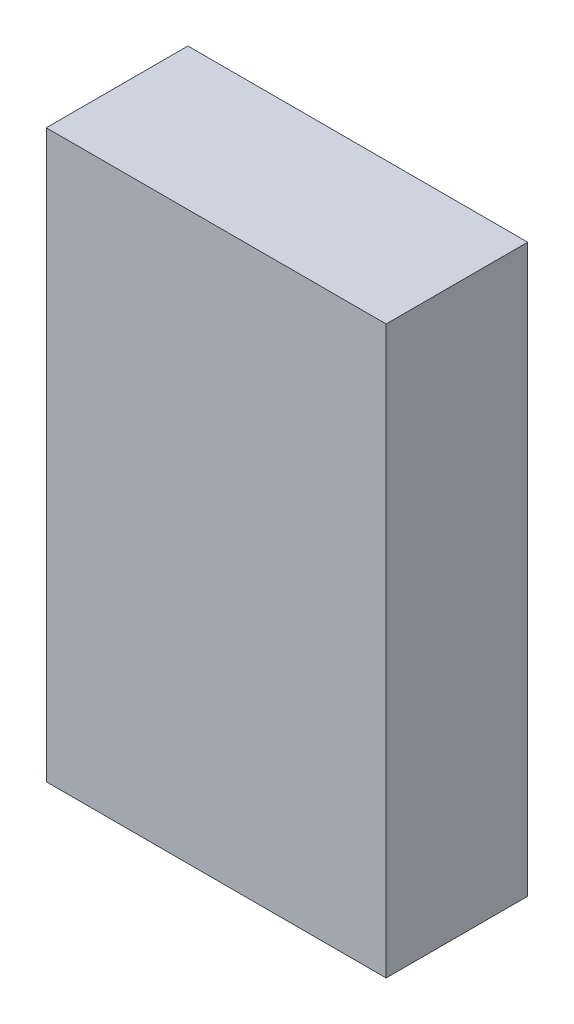
ISO-10303-21;
HEADER;
FILE_DESCRIPTION(('STEP AP214'),'2;1');
FILE_NAME('part.step','',(''),(''),'','','');
FILE_SCHEMA(('AUTOMOTIVE_DESIGN { 1 0 10303 214 1 1 1 1 }'));
ENDSEC;
DATA;
#1=APPLICATION_CONTEXT('core data for automotive mechanical design processes');
#2=APPLICATION_PROTOCOL_DEFINITION('international standard','automotive_design',2000,#1);
#3=PRODUCT_CONTEXT('',#1,'mechanical');
#4=PRODUCT('Part','Part','',(#3));
#5=PRODUCT_RELATED_PRODUCT_CATEGORY('part','',(#4));
#6=PRODUCT_DEFINITION_FORMATION('','',#4);
#7=PRODUCT_DEFINITION_CONTEXT('part definition',#1,'design');
#8=PRODUCT_DEFINITION('design','',#6,#7);
#9=PRODUCT_DEFINITION_SHAPE('','',#8);
#10=(LENGTH_UNIT() NAMED_UNIT(*) SI_UNIT(.MILLI.,.METRE.));
#11=(NAMED_UNIT(*) PLANE_ANGLE_UNIT() SI_UNIT($,.RADIAN.));
#12=(NAMED_UNIT(*) SI_UNIT($,.STERADIAN.) SOLID_ANGLE_UNIT());
#13=UNCERTAINTY_MEASURE_WITH_UNIT(LENGTH_MEASURE(1.E-05),#10,'distance_accuracy_value','');
#14=(GEOMETRIC_REPRESENTATION_CONTEXT(3) GLOBAL_UNCERTAINTY_ASSIGNED_CONTEXT((#13)) GLOBAL_UNIT_ASSIGNED_CONTEXT((#10,
#11,#12)) REPRESENTATION_CONTEXT('',''));
#15=CARTESIAN_POINT('',(0.,0.,0.));
#16=DIRECTION('',(0.,0.,1.));
#17=DIRECTION('',(1.,0.,0.));
#18=AXIS2_PLACEMENT_3D('',#15,#16,#17);
#19=CARTESIAN_POINT('',(-8.53676470588236,6.02941176470588,2.5));
#20=DIRECTION('',(1.,0.,0.));
#21=DIRECTION('',(0.,1.,0.));
#22=AXIS2_PLACEMENT_3D('',#19,#20,#21);
#23=PLANE('',#22);
#24=DIRECTION('',(0.,-1.,0.));
#25=VECTOR('',#24,1.);
#26=CARTESIAN_POINT('',(-8.53676470588236,6.02941176470588,0.));
#27=LINE('',#26,#25);
#28=CARTESIAN_POINT('',(-8.53676470588236,6.02941176470588,0.));
#29=VERTEX_POINT('',#28);
#30=CARTESIAN_POINT('',(-8.53676470588236,-3.97058823529412,0.));
#31=VERTEX_POINT('',#30);
#32=EDGE_CURVE('E96',#29,#31,#27,.T.);
#33=ORIENTED_EDGE('',*,*,#32,.T.);
#34=DIRECTION('',(0.,0.,-1.));
#35=VECTOR('',#34,1.);
#36=CARTESIAN_POINT('',(-8.53676470588236,-3.97058823529412,2.5));
#37=LINE('',#36,#35);
#38=CARTESIAN_POINT('',(-8.53676470588236,-3.97058823529412,2.5));
#39=VERTEX_POINT('',#38);
#40=EDGE_CURVE('E11',#39,#31,#37,.T.);
#41=ORIENTED_EDGE('',*,*,#40,.F.);
#42=DIRECTION('',(0.,-1.,0.));
#43=VECTOR('',#42,1.);
#44=CARTESIAN_POINT('',(-8.53676470588236,6.02941176470588,2.5));
#45=LINE('',#44,#43);
#46=CARTESIAN_POINT('',(-8.53676470588236,6.02941176470588,2.5));
#47=VERTEX_POINT('',#46);
#48=EDGE_CURVE('E84',#47,#39,#45,.T.);
#49=ORIENTED_EDGE('',*,*,#48,.F.);
#50=DIRECTION('',(0.,0.,-1.));
#51=VECTOR('',#50,1.);
#52=CARTESIAN_POINT('',(-8.53676470588236,6.02941176470588,2.5));
#53=LINE('',#52,#51);
#54=EDGE_CURVE('E92',#47,#29,#53,.T.);
#55=ORIENTED_EDGE('',*,*,#54,.T.);
#56=EDGE_LOOP('',(#33,#41,#49,#55));
#57=FACE_BOUND('',#56,.T.);
#58=ADVANCED_FACE('F33',(#57),#23,.F.);
#59=CARTESIAN_POINT('',(-8.53676470588236,-3.97058823529412,2.5));
#60=DIRECTION('',(0.,1.,0.));
#61=DIRECTION('',(0.,0.,1.));
#62=AXIS2_PLACEMENT_3D('',#59,#60,#61);
#63=PLANE('',#62);
#64=DIRECTION('',(1.,0.,0.));
#65=VECTOR('',#64,1.);
#66=CARTESIAN_POINT('',(-8.53676470588236,-3.97058823529412,0.));
#67=LINE('',#66,#65);
#68=CARTESIAN_POINT('',(-2.53676470588236,-3.97058823529412,0.));
#69=VERTEX_POINT('',#68);
#70=EDGE_CURVE('E88',#31,#69,#67,.T.);
#71=ORIENTED_EDGE('',*,*,#70,.T.);
#72=DIRECTION('',(0.,0.,-1.));
#73=VECTOR('',#72,1.);
#74=CARTESIAN_POINT('',(-2.53676470588236,-3.97058823529412,2.5));
#75=LINE('',#74,#73);
#76=CARTESIAN_POINT('',(-2.53676470588236,-3.97058823529412,2.5));
#77=VERTEX_POINT('',#76);
#78=EDGE_CURVE('E41',#77,#69,#75,.T.);
#79=ORIENTED_EDGE('',*,*,#78,.F.);
#80=DIRECTION('',(1.,0.,0.));
#81=VECTOR('',#80,1.);
#82=CARTESIAN_POINT('',(-8.53676470588236,-3.97058823529412,2.5));
#83=LINE('',#82,#81);
#84=EDGE_CURVE('E79',#39,#77,#83,.T.);
#85=ORIENTED_EDGE('',*,*,#84,.F.);
#86=ORIENTED_EDGE('',*,*,#40,.T.);
#87=EDGE_LOOP('',(#71,#79,#85,#86));
#88=FACE_BOUND('',#87,.T.);
#89=ADVANCED_FACE('F87',(#88),#63,.F.);
#90=CARTESIAN_POINT('',(-2.53676470588236,6.02941176470588,2.5));
#91=DIRECTION('',(-1.,0.,0.));
#92=DIRECTION('',(0.,-1.,0.));
#93=AXIS2_PLACEMENT_3D('',#90,#91,#92);
#94=PLANE('',#93);
#95=DIRECTION('',(0.,1.,0.));
#96=VECTOR('',#95,1.);
#97=CARTESIAN_POINT('',(-2.53676470588236,6.02941176470588,0.));
#98=LINE('',#97,#96);
#99=CARTESIAN_POINT('',(-2.53676470588236,6.02941176470588,0.));
#100=VERTEX_POINT('',#99);
#101=EDGE_CURVE('E66',#69,#100,#98,.T.);
#102=ORIENTED_EDGE('',*,*,#101,.T.);
#103=DIRECTION('',(0.,0.,-1.));
#104=VECTOR('',#103,1.);
#105=CARTESIAN_POINT('',(-2.53676470588236,6.02941176470588,2.5));
#106=LINE('',#105,#104);
#107=CARTESIAN_POINT('',(-2.53676470588236,6.02941176470588,2.5));
#108=VERTEX_POINT('',#107);
#109=EDGE_CURVE('E89',#108,#100,#106,.T.);
#110=ORIENTED_EDGE('',*,*,#109,.F.);
#111=DIRECTION('',(0.,1.,0.));
#112=VECTOR('',#111,1.);
#113=CARTESIAN_POINT('',(-2.53676470588236,6.02941176470588,2.5));
#114=LINE('',#113,#112);
#115=EDGE_CURVE('E82',#77,#108,#114,.T.);
#116=ORIENTED_EDGE('',*,*,#115,.F.);
#117=ORIENTED_EDGE('',*,*,#78,.T.);
#118=EDGE_LOOP('',(#102,#110,#116,#117));
#119=FACE_BOUND('',#118,.T.);
#120=ADVANCED_FACE('F90',(#119),#94,.F.);
#121=CARTESIAN_POINT('',(-8.53676470588236,6.02941176470588,2.5));
#122=DIRECTION('',(0.,-1.,0.));
#123=DIRECTION('',(0.,0.,-1.));
#124=AXIS2_PLACEMENT_3D('',#121,#122,#123);
#125=PLANE('',#124);
#126=DIRECTION('',(-1.,0.,0.));
#127=VECTOR('',#126,1.);
#128=CARTESIAN_POINT('',(-8.53676470588236,6.02941176470588,0.));
#129=LINE('',#128,#127);
#130=EDGE_CURVE('E72',#100,#29,#129,.T.);
#131=ORIENTED_EDGE('',*,*,#130,.T.);
#132=ORIENTED_EDGE('',*,*,#54,.F.);
#133=DIRECTION('',(-1.,0.,0.));
#134=VECTOR('',#133,1.);
#135=CARTESIAN_POINT('',(-8.53676470588236,6.02941176470588,2.5));
#136=LINE('',#135,#134);
#137=EDGE_CURVE('E49',#108,#47,#136,.T.);
#138=ORIENTED_EDGE('',*,*,#137,.F.);
#139=ORIENTED_EDGE('',*,*,#109,.T.);
#140=EDGE_LOOP('',(#131,#132,#138,#139));
#141=FACE_BOUND('',#140,.T.);
#142=ADVANCED_FACE('F103',(#141),#125,.F.);
#143=CARTESIAN_POINT('',(0.,0.,2.5));
#144=DIRECTION('',(0.,0.,1.));
#145=DIRECTION('',(1.,0.,0.));
#146=AXIS2_PLACEMENT_3D('',#143,#144,#145);
#147=PLANE('',#146);
#148=ORIENTED_EDGE('',*,*,#48,.T.);
#149=ORIENTED_EDGE('',*,*,#84,.T.);
#150=ORIENTED_EDGE('',*,*,#115,.T.);
#151=ORIENTED_EDGE('',*,*,#137,.T.);
#152=EDGE_LOOP('',(#148,#149,#150,#151));
#153=FACE_BOUND('',#152,.T.);
#154=ADVANCED_FACE('F80',(#153),#147,.T.);
#155=CARTESIAN_POINT('',(0.,0.,0.));
#156=DIRECTION('',(0.,0.,1.));
#157=DIRECTION('',(1.,0.,0.));
#158=AXIS2_PLACEMENT_3D('',#155,#156,#157);
#159=PLANE('',#158);
#160=ORIENTED_EDGE('',*,*,#32,.F.);
#161=ORIENTED_EDGE('',*,*,#130,.F.);
#162=ORIENTED_EDGE('',*,*,#101,.F.);
#163=ORIENTED_EDGE('',*,*,#70,.F.);
#164=EDGE_LOOP('',(#160,#161,#162,#163));
#165=FACE_BOUND('',#164,.T.);
#166=ADVANCED_FACE('F106',(#165),#159,.F.);
#167=CLOSED_SHELL('',(#58,#89,#120,#142,#154,#166));
#168=MANIFOLD_SOLID_BREP('B2',#167);
#169=ADVANCED_BREP_SHAPE_REPRESENTATION('',(#18,#168),#14);
#170=SHAPE_DEFINITION_REPRESENTATION(#9,#169);
ENDSEC;
END-ISO-10303-21;
